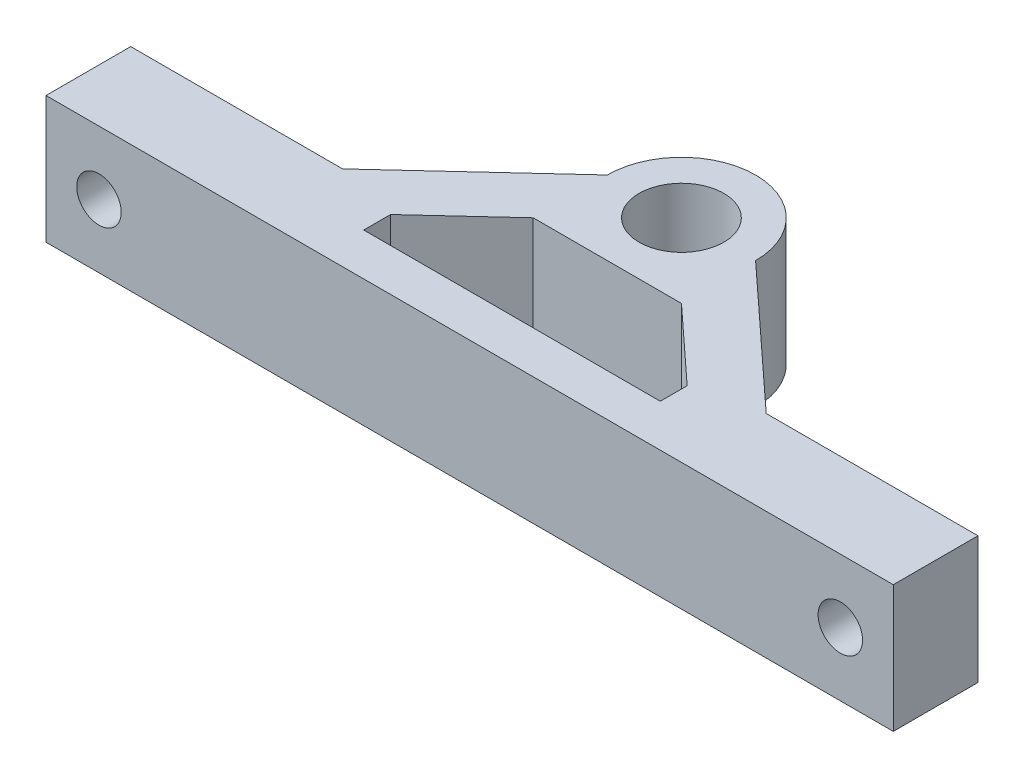
ISO-10303-21;
HEADER;
FILE_DESCRIPTION(('STEP AP214'),'2;1');
FILE_NAME('part.step','',(''),(''),'','','');
FILE_SCHEMA(('AUTOMOTIVE_DESIGN { 1 0 10303 214 1 1 1 1 }'));
ENDSEC;
DATA;
#1=APPLICATION_CONTEXT('core data for automotive mechanical design processes');
#2=APPLICATION_PROTOCOL_DEFINITION('international standard','automotive_design',2000,#1);
#3=PRODUCT_CONTEXT('',#1,'mechanical');
#4=PRODUCT('Part','Part','',(#3));
#5=PRODUCT_RELATED_PRODUCT_CATEGORY('part','',(#4));
#6=PRODUCT_DEFINITION_FORMATION('','',#4);
#7=PRODUCT_DEFINITION_CONTEXT('part definition',#1,'design');
#8=PRODUCT_DEFINITION('design','',#6,#7);
#9=PRODUCT_DEFINITION_SHAPE('','',#8);
#10=(LENGTH_UNIT() NAMED_UNIT(*) SI_UNIT(.MILLI.,.METRE.));
#11=(NAMED_UNIT(*) PLANE_ANGLE_UNIT() SI_UNIT($,.RADIAN.));
#12=(NAMED_UNIT(*) SI_UNIT($,.STERADIAN.) SOLID_ANGLE_UNIT());
#13=UNCERTAINTY_MEASURE_WITH_UNIT(LENGTH_MEASURE(1.E-05),#10,'distance_accuracy_value','');
#14=(GEOMETRIC_REPRESENTATION_CONTEXT(3) GLOBAL_UNCERTAINTY_ASSIGNED_CONTEXT((#13)) GLOBAL_UNIT_ASSIGNED_CONTEXT((#10,
#11,#12)) REPRESENTATION_CONTEXT('',''));
#15=CARTESIAN_POINT('',(0.,0.,0.));
#16=DIRECTION('',(0.,0.,1.));
#17=DIRECTION('',(1.,0.,0.));
#18=AXIS2_PLACEMENT_3D('',#15,#16,#17);
#19=CARTESIAN_POINT('',(0.,12.,0.));
#20=DIRECTION('',(0.,1.,0.));
#21=DIRECTION('',(0.,0.,1.));
#22=AXIS2_PLACEMENT_3D('',#19,#20,#21);
#23=PLANE('',#22);
#24=DIRECTION('',(0.,0.,1.));
#25=VECTOR('',#24,1.);
#26=CARTESIAN_POINT('',(-40.,12.,20.));
#27=LINE('',#26,#25);
#28=CARTESIAN_POINT('',(-40.,12.,12.));
#29=VERTEX_POINT('',#28);
#30=CARTESIAN_POINT('',(-40.,12.,20.));
#31=VERTEX_POINT('',#30);
#32=EDGE_CURVE('E195',#29,#31,#27,.T.);
#33=ORIENTED_EDGE('',*,*,#32,.T.);
#34=DIRECTION('',(1.,0.,0.));
#35=VECTOR('',#34,1.);
#36=CARTESIAN_POINT('',(-40.,12.,20.));
#37=LINE('',#36,#35);
#38=CARTESIAN_POINT('',(40.,12.,20.));
#39=VERTEX_POINT('',#38);
#40=EDGE_CURVE('E198',#31,#39,#37,.T.);
#41=ORIENTED_EDGE('',*,*,#40,.T.);
#42=DIRECTION('',(0.,0.,-1.));
#43=VECTOR('',#42,1.);
#44=CARTESIAN_POINT('',(40.,12.,20.));
#45=LINE('',#44,#43);
#46=CARTESIAN_POINT('',(40.,12.,12.));
#47=VERTEX_POINT('',#46);
#48=EDGE_CURVE('E201',#39,#47,#45,.T.);
#49=ORIENTED_EDGE('',*,*,#48,.T.);
#50=DIRECTION('',(-1.,0.,0.));
#51=VECTOR('',#50,1.);
#52=CARTESIAN_POINT('',(40.,12.,12.));
#53=LINE('',#52,#51);
#54=CARTESIAN_POINT('',(20.,12.,12.));
#55=VERTEX_POINT('',#54);
#56=EDGE_CURVE('E203',#47,#55,#53,.T.);
#57=ORIENTED_EDGE('',*,*,#56,.T.);
#58=DIRECTION('',(-0.734803444627488,0.,-0.678280102733065));
#59=VECTOR('',#58,1.);
#60=CARTESIAN_POINT('',(20.,12.,12.));
#61=LINE('',#60,#59);
#62=CARTESIAN_POINT('',(7.,12.,0.));
#63=VERTEX_POINT('',#62);
#64=EDGE_CURVE('E205',#55,#63,#61,.T.);
#65=ORIENTED_EDGE('',*,*,#64,.T.);
#66=CARTESIAN_POINT('',(0.,12.,0.));
#67=DIRECTION('',(0.,1.,0.));
#68=DIRECTION('',(0.,0.,1.));
#69=AXIS2_PLACEMENT_3D('',#66,#67,#68);
#70=CIRCLE('',#69,7.);
#71=CARTESIAN_POINT('',(-7.,12.,0.));
#72=VERTEX_POINT('',#71);
#73=EDGE_CURVE('E207',#63,#72,#70,.T.);
#74=ORIENTED_EDGE('',*,*,#73,.T.);
#75=DIRECTION('',(-0.734803444627488,0.,0.678280102733066));
#76=VECTOR('',#75,1.);
#77=CARTESIAN_POINT('',(-20.,12.,12.));
#78=LINE('',#77,#76);
#79=CARTESIAN_POINT('',(-20.,12.,12.));
#80=VERTEX_POINT('',#79);
#81=EDGE_CURVE('E209',#72,#80,#78,.T.);
#82=ORIENTED_EDGE('',*,*,#81,.T.);
#83=DIRECTION('',(-1.,0.,0.));
#84=VECTOR('',#83,1.);
#85=CARTESIAN_POINT('',(-40.,12.,12.));
#86=LINE('',#85,#84);
#87=EDGE_CURVE('E211',#80,#29,#86,.T.);
#88=ORIENTED_EDGE('',*,*,#87,.T.);
#89=EDGE_LOOP('',(#33,#41,#49,#57,#65,#74,#82,#88));
#90=FACE_BOUND('',#89,.T.);
#91=CARTESIAN_POINT('',(0.,12.,0.));
#92=DIRECTION('',(0.,1.,0.));
#93=DIRECTION('',(0.,0.,1.));
#94=AXIS2_PLACEMENT_3D('',#91,#92,#93);
#95=CIRCLE('',#94,4.);
#96=CARTESIAN_POINT('',(0.,12.,4.));
#97=VERTEX_POINT('',#96);
#98=EDGE_CURVE('E189',#97,#97,#95,.T.);
#99=ORIENTED_EDGE('',*,*,#98,.F.);
#100=EDGE_LOOP('',(#99));
#101=FACE_BOUND('',#100,.T.);
#102=DIRECTION('',(1.,0.,0.));
#103=VECTOR('',#102,1.);
#104=CARTESIAN_POINT('',(-14.,12.,16.));
#105=LINE('',#104,#103);
#106=CARTESIAN_POINT('',(-14.,12.,16.));
#107=VERTEX_POINT('',#106);
#108=CARTESIAN_POINT('',(14.,12.,16.));
#109=VERTEX_POINT('',#108);
#110=EDGE_CURVE('E144',#107,#109,#105,.T.);
#111=ORIENTED_EDGE('',*,*,#110,.F.);
#112=DIRECTION('',(0.,0.,1.));
#113=VECTOR('',#112,1.);
#114=CARTESIAN_POINT('',(-14.,12.,13.4615384615385));
#115=LINE('',#114,#113);
#116=CARTESIAN_POINT('',(-14.,12.,13.4615384615385));
#117=VERTEX_POINT('',#116);
#118=EDGE_CURVE('E136',#117,#107,#115,.T.);
#119=ORIENTED_EDGE('',*,*,#118,.F.);
#120=DIRECTION('',(-0.734803444627488,0.,0.678280102733066));
#121=VECTOR('',#120,1.);
#122=CARTESIAN_POINT('',(-7.,12.,7.));
#123=LINE('',#122,#121);
#124=CARTESIAN_POINT('',(-7.,12.,7.));
#125=VERTEX_POINT('',#124);
#126=EDGE_CURVE('E166',#125,#117,#123,.T.);
#127=ORIENTED_EDGE('',*,*,#126,.F.);
#128=DIRECTION('',(-1.,0.,0.));
#129=VECTOR('',#128,1.);
#130=CARTESIAN_POINT('',(7.,12.,7.));
#131=LINE('',#130,#129);
#132=CARTESIAN_POINT('',(7.,12.,7.));
#133=VERTEX_POINT('',#132);
#134=EDGE_CURVE('E164',#133,#125,#131,.T.);
#135=ORIENTED_EDGE('',*,*,#134,.F.);
#136=DIRECTION('',(-0.734803444627488,0.,-0.678280102733066));
#137=VECTOR('',#136,1.);
#138=CARTESIAN_POINT('',(14.,12.,13.4615384615385));
#139=LINE('',#138,#137);
#140=CARTESIAN_POINT('',(14.,12.,13.4615384615385));
#141=VERTEX_POINT('',#140);
#142=EDGE_CURVE('E159',#141,#133,#139,.T.);
#143=ORIENTED_EDGE('',*,*,#142,.F.);
#144=DIRECTION('',(0.,0.,-1.));
#145=VECTOR('',#144,1.);
#146=CARTESIAN_POINT('',(14.,12.,16.));
#147=LINE('',#146,#145);
#148=EDGE_CURVE('E157',#109,#141,#147,.T.);
#149=ORIENTED_EDGE('',*,*,#148,.F.);
#150=EDGE_LOOP('',(#111,#119,#127,#135,#143,#149));
#151=FACE_BOUND('',#150,.T.);
#152=ADVANCED_FACE('F35',(#90,#101,#151),#23,.T.);
#153=CARTESIAN_POINT('',(0.,0.,0.));
#154=DIRECTION('',(0.,1.,0.));
#155=DIRECTION('',(0.,0.,1.));
#156=AXIS2_PLACEMENT_3D('',#153,#154,#155);
#157=PLANE('',#156);
#158=CARTESIAN_POINT('',(0.,0.,0.));
#159=DIRECTION('',(0.,1.,0.));
#160=DIRECTION('',(0.,0.,1.));
#161=AXIS2_PLACEMENT_3D('',#158,#159,#160);
#162=CIRCLE('',#161,4.);
#163=CARTESIAN_POINT('',(0.,0.,4.));
#164=VERTEX_POINT('',#163);
#165=EDGE_CURVE('E152',#164,#164,#162,.T.);
#166=ORIENTED_EDGE('',*,*,#165,.T.);
#167=EDGE_LOOP('',(#166));
#168=FACE_BOUND('',#167,.T.);
#169=DIRECTION('',(0.,0.,1.));
#170=VECTOR('',#169,1.);
#171=CARTESIAN_POINT('',(-40.,0.,20.));
#172=LINE('',#171,#170);
#173=CARTESIAN_POINT('',(-40.,0.,12.));
#174=VERTEX_POINT('',#173);
#175=CARTESIAN_POINT('',(-40.,0.,20.));
#176=VERTEX_POINT('',#175);
#177=EDGE_CURVE('E192',#174,#176,#172,.T.);
#178=ORIENTED_EDGE('',*,*,#177,.F.);
#179=DIRECTION('',(-1.,0.,0.));
#180=VECTOR('',#179,1.);
#181=CARTESIAN_POINT('',(-40.,0.,12.));
#182=LINE('',#181,#180);
#183=CARTESIAN_POINT('',(-20.,0.,12.));
#184=VERTEX_POINT('',#183);
#185=EDGE_CURVE('E199',#184,#174,#182,.T.);
#186=ORIENTED_EDGE('',*,*,#185,.F.);
#187=DIRECTION('',(-0.734803444627488,0.,0.678280102733066));
#188=VECTOR('',#187,1.);
#189=CARTESIAN_POINT('',(-20.,0.,12.));
#190=LINE('',#189,#188);
#191=CARTESIAN_POINT('',(-7.,0.,0.));
#192=VERTEX_POINT('',#191);
#193=EDGE_CURVE('E226',#192,#184,#190,.T.);
#194=ORIENTED_EDGE('',*,*,#193,.F.);
#195=CARTESIAN_POINT('',(0.,0.,0.));
#196=DIRECTION('',(0.,1.,0.));
#197=DIRECTION('',(0.,0.,1.));
#198=AXIS2_PLACEMENT_3D('',#195,#196,#197);
#199=CIRCLE('',#198,7.);
#200=CARTESIAN_POINT('',(7.,0.,0.));
#201=VERTEX_POINT('',#200);
#202=EDGE_CURVE('E224',#201,#192,#199,.T.);
#203=ORIENTED_EDGE('',*,*,#202,.F.);
#204=DIRECTION('',(-0.734803444627488,0.,-0.678280102733065));
#205=VECTOR('',#204,1.);
#206=CARTESIAN_POINT('',(20.,0.,12.));
#207=LINE('',#206,#205);
#208=CARTESIAN_POINT('',(20.,0.,12.));
#209=VERTEX_POINT('',#208);
#210=EDGE_CURVE('E222',#209,#201,#207,.T.);
#211=ORIENTED_EDGE('',*,*,#210,.F.);
#212=DIRECTION('',(-1.,0.,0.));
#213=VECTOR('',#212,1.);
#214=CARTESIAN_POINT('',(40.,0.,12.));
#215=LINE('',#214,#213);
#216=CARTESIAN_POINT('',(40.,0.,12.));
#217=VERTEX_POINT('',#216);
#218=EDGE_CURVE('E220',#217,#209,#215,.T.);
#219=ORIENTED_EDGE('',*,*,#218,.F.);
#220=DIRECTION('',(0.,0.,-1.));
#221=VECTOR('',#220,1.);
#222=CARTESIAN_POINT('',(40.,0.,20.));
#223=LINE('',#222,#221);
#224=CARTESIAN_POINT('',(40.,0.,20.));
#225=VERTEX_POINT('',#224);
#226=EDGE_CURVE('E218',#225,#217,#223,.T.);
#227=ORIENTED_EDGE('',*,*,#226,.F.);
#228=DIRECTION('',(1.,0.,0.));
#229=VECTOR('',#228,1.);
#230=CARTESIAN_POINT('',(-40.,0.,20.));
#231=LINE('',#230,#229);
#232=EDGE_CURVE('E216',#176,#225,#231,.T.);
#233=ORIENTED_EDGE('',*,*,#232,.F.);
#234=EDGE_LOOP('',(#178,#186,#194,#203,#211,#219,#227,#233));
#235=FACE_BOUND('',#234,.T.);
#236=DIRECTION('',(0.,0.,1.));
#237=VECTOR('',#236,1.);
#238=CARTESIAN_POINT('',(-14.,0.,13.4615384615385));
#239=LINE('',#238,#237);
#240=CARTESIAN_POINT('',(-14.,0.,13.4615384615385));
#241=VERTEX_POINT('',#240);
#242=CARTESIAN_POINT('',(-14.,0.,16.));
#243=VERTEX_POINT('',#242);
#244=EDGE_CURVE('E58',#241,#243,#239,.T.);
#245=ORIENTED_EDGE('',*,*,#244,.T.);
#246=DIRECTION('',(1.,0.,0.));
#247=VECTOR('',#246,1.);
#248=CARTESIAN_POINT('',(-14.,0.,16.));
#249=LINE('',#248,#247);
#250=CARTESIAN_POINT('',(14.,0.,16.));
#251=VERTEX_POINT('',#250);
#252=EDGE_CURVE('E151',#243,#251,#249,.T.);
#253=ORIENTED_EDGE('',*,*,#252,.T.);
#254=DIRECTION('',(0.,0.,-1.));
#255=VECTOR('',#254,1.);
#256=CARTESIAN_POINT('',(14.,0.,16.));
#257=LINE('',#256,#255);
#258=CARTESIAN_POINT('',(14.,0.,13.4615384615385));
#259=VERTEX_POINT('',#258);
#260=EDGE_CURVE('E171',#251,#259,#257,.T.);
#261=ORIENTED_EDGE('',*,*,#260,.T.);
#262=DIRECTION('',(-0.734803444627488,0.,-0.678280102733066));
#263=VECTOR('',#262,1.);
#264=CARTESIAN_POINT('',(14.,0.,13.4615384615385));
#265=LINE('',#264,#263);
#266=CARTESIAN_POINT('',(7.,0.,7.));
#267=VERTEX_POINT('',#266);
#268=EDGE_CURVE('E174',#259,#267,#265,.T.);
#269=ORIENTED_EDGE('',*,*,#268,.T.);
#270=DIRECTION('',(-1.,0.,0.));
#271=VECTOR('',#270,1.);
#272=CARTESIAN_POINT('',(7.,0.,7.));
#273=LINE('',#272,#271);
#274=CARTESIAN_POINT('',(-7.,0.,7.));
#275=VERTEX_POINT('',#274);
#276=EDGE_CURVE('E177',#267,#275,#273,.T.);
#277=ORIENTED_EDGE('',*,*,#276,.T.);
#278=DIRECTION('',(-0.734803444627488,0.,0.678280102733066));
#279=VECTOR('',#278,1.);
#280=CARTESIAN_POINT('',(-7.,0.,7.));
#281=LINE('',#280,#279);
#282=EDGE_CURVE('E145',#275,#241,#281,.T.);
#283=ORIENTED_EDGE('',*,*,#282,.T.);
#284=EDGE_LOOP('',(#245,#253,#261,#269,#277,#283));
#285=FACE_BOUND('',#284,.T.);
#286=ADVANCED_FACE('F256',(#168,#235,#285),#157,.F.);
#287=CARTESIAN_POINT('',(-40.,12.,20.));
#288=DIRECTION('',(1.,0.,0.));
#289=DIRECTION('',(0.,0.,-1.));
#290=AXIS2_PLACEMENT_3D('',#287,#288,#289);
#291=PLANE('',#290);
#292=ORIENTED_EDGE('',*,*,#177,.T.);
#293=DIRECTION('',(0.,-1.,0.));
#294=VECTOR('',#293,1.);
#295=CARTESIAN_POINT('',(-40.,12.,20.));
#296=LINE('',#295,#294);
#297=EDGE_CURVE('E11',#31,#176,#296,.T.);
#298=ORIENTED_EDGE('',*,*,#297,.F.);
#299=ORIENTED_EDGE('',*,*,#32,.F.);
#300=DIRECTION('',(0.,-1.,0.));
#301=VECTOR('',#300,1.);
#302=CARTESIAN_POINT('',(-40.,12.,12.));
#303=LINE('',#302,#301);
#304=EDGE_CURVE('E213',#29,#174,#303,.T.);
#305=ORIENTED_EDGE('',*,*,#304,.T.);
#306=EDGE_LOOP('',(#292,#298,#299,#305));
#307=FACE_BOUND('',#306,.T.);
#308=ADVANCED_FACE('F37',(#307),#291,.F.);
#309=CARTESIAN_POINT('',(-40.,12.,20.));
#310=DIRECTION('',(0.,0.,-1.));
#311=DIRECTION('',(-1.,0.,0.));
#312=AXIS2_PLACEMENT_3D('',#309,#310,#311);
#313=PLANE('',#312);
#314=CARTESIAN_POINT('',(-35.,6.,20.));
#315=DIRECTION('',(0.,0.,1.));
#316=DIRECTION('',(1.,0.,0.));
#317=AXIS2_PLACEMENT_3D('',#314,#315,#316);
#318=CIRCLE('',#317,2.1);
#319=CARTESIAN_POINT('',(-32.9,6.,20.));
#320=VERTEX_POINT('',#319);
#321=EDGE_CURVE('E318',#320,#320,#318,.T.);
#322=ORIENTED_EDGE('',*,*,#321,.F.);
#323=EDGE_LOOP('',(#322));
#324=FACE_BOUND('',#323,.T.);
#325=CARTESIAN_POINT('',(35.,6.,20.));
#326=DIRECTION('',(0.,0.,1.));
#327=DIRECTION('',(1.,0.,0.));
#328=AXIS2_PLACEMENT_3D('',#325,#326,#327);
#329=CIRCLE('',#328,2.1);
#330=CARTESIAN_POINT('',(37.1,6.,20.));
#331=VERTEX_POINT('',#330);
#332=EDGE_CURVE('E317',#331,#331,#329,.T.);
#333=ORIENTED_EDGE('',*,*,#332,.F.);
#334=EDGE_LOOP('',(#333));
#335=FACE_BOUND('',#334,.T.);
#336=ORIENTED_EDGE('',*,*,#232,.T.);
#337=DIRECTION('',(0.,-1.,0.));
#338=VECTOR('',#337,1.);
#339=CARTESIAN_POINT('',(40.,12.,20.));
#340=LINE('',#339,#338);
#341=EDGE_CURVE('E43',#39,#225,#340,.T.);
#342=ORIENTED_EDGE('',*,*,#341,.F.);
#343=ORIENTED_EDGE('',*,*,#40,.F.);
#344=ORIENTED_EDGE('',*,*,#297,.T.);
#345=EDGE_LOOP('',(#336,#342,#343,#344));
#346=FACE_BOUND('',#345,.T.);
#347=ADVANCED_FACE('F274',(#324,#335,#346),#313,.F.);
#348=CARTESIAN_POINT('',(40.,12.,20.));
#349=DIRECTION('',(-1.,0.,0.));
#350=DIRECTION('',(0.,0.,1.));
#351=AXIS2_PLACEMENT_3D('',#348,#349,#350);
#352=PLANE('',#351);
#353=ORIENTED_EDGE('',*,*,#226,.T.);
#354=DIRECTION('',(0.,-1.,0.));
#355=VECTOR('',#354,1.);
#356=CARTESIAN_POINT('',(40.,12.,12.));
#357=LINE('',#356,#355);
#358=EDGE_CURVE('E243',#47,#217,#357,.T.);
#359=ORIENTED_EDGE('',*,*,#358,.F.);
#360=ORIENTED_EDGE('',*,*,#48,.F.);
#361=ORIENTED_EDGE('',*,*,#341,.T.);
#362=EDGE_LOOP('',(#353,#359,#360,#361));
#363=FACE_BOUND('',#362,.T.);
#364=ADVANCED_FACE('F250',(#363),#352,.F.);
#365=CARTESIAN_POINT('',(40.,12.,12.));
#366=DIRECTION('',(0.,0.,1.));
#367=DIRECTION('',(1.,0.,0.));
#368=AXIS2_PLACEMENT_3D('',#365,#366,#367);
#369=PLANE('',#368);
#370=CARTESIAN_POINT('',(35.,6.,12.));
#371=DIRECTION('',(0.,0.,1.));
#372=DIRECTION('',(1.,0.,0.));
#373=AXIS2_PLACEMENT_3D('',#370,#371,#372);
#374=CIRCLE('',#373,2.1);
#375=CARTESIAN_POINT('',(37.1,6.,12.));
#376=VERTEX_POINT('',#375);
#377=EDGE_CURVE('E169',#376,#376,#374,.T.);
#378=ORIENTED_EDGE('',*,*,#377,.T.);
#379=EDGE_LOOP('',(#378));
#380=FACE_BOUND('',#379,.T.);
#381=ORIENTED_EDGE('',*,*,#218,.T.);
#382=DIRECTION('',(0.,-1.,0.));
#383=VECTOR('',#382,1.);
#384=CARTESIAN_POINT('',(20.,12.,12.));
#385=LINE('',#384,#383);
#386=EDGE_CURVE('E240',#55,#209,#385,.T.);
#387=ORIENTED_EDGE('',*,*,#386,.F.);
#388=ORIENTED_EDGE('',*,*,#56,.F.);
#389=ORIENTED_EDGE('',*,*,#358,.T.);
#390=EDGE_LOOP('',(#381,#387,#388,#389));
#391=FACE_BOUND('',#390,.T.);
#392=ADVANCED_FACE('F262',(#380,#391),#369,.F.);
#393=CARTESIAN_POINT('',(20.,12.,12.));
#394=DIRECTION('',(-0.678280102733066,0.,0.734803444627488));
#395=DIRECTION('',(0.734803444627488,0.,0.678280102733066));
#396=AXIS2_PLACEMENT_3D('',#393,#394,#395);
#397=PLANE('',#396);
#398=ORIENTED_EDGE('',*,*,#210,.T.);
#399=DIRECTION('',(0.,-1.,0.));
#400=VECTOR('',#399,1.);
#401=CARTESIAN_POINT('',(7.,12.,0.));
#402=LINE('',#401,#400);
#403=EDGE_CURVE('E237',#63,#201,#402,.T.);
#404=ORIENTED_EDGE('',*,*,#403,.F.);
#405=ORIENTED_EDGE('',*,*,#64,.F.);
#406=ORIENTED_EDGE('',*,*,#386,.T.);
#407=EDGE_LOOP('',(#398,#404,#405,#406));
#408=FACE_BOUND('',#407,.T.);
#409=ADVANCED_FACE('F266',(#408),#397,.F.);
#410=CARTESIAN_POINT('',(0.,12.,0.));
#411=DIRECTION('',(0.,-1.,0.));
#412=DIRECTION('',(0.,0.,-1.));
#413=AXIS2_PLACEMENT_3D('',#410,#411,#412);
#414=CYLINDRICAL_SURFACE('',#413,7.);
#415=ORIENTED_EDGE('',*,*,#202,.T.);
#416=DIRECTION('',(0.,-1.,0.));
#417=VECTOR('',#416,1.);
#418=CARTESIAN_POINT('',(-7.,12.,0.));
#419=LINE('',#418,#417);
#420=EDGE_CURVE('E234',#72,#192,#419,.T.);
#421=ORIENTED_EDGE('',*,*,#420,.F.);
#422=ORIENTED_EDGE('',*,*,#73,.F.);
#423=ORIENTED_EDGE('',*,*,#403,.T.);
#424=EDGE_LOOP('',(#415,#421,#422,#423));
#425=FACE_BOUND('',#424,.T.);
#426=ADVANCED_FACE('F287',(#425),#414,.T.);
#427=CARTESIAN_POINT('',(-20.,12.,12.));
#428=DIRECTION('',(0.678280102733066,0.,0.734803444627488));
#429=DIRECTION('',(0.734803444627488,0.,-0.678280102733066));
#430=AXIS2_PLACEMENT_3D('',#427,#428,#429);
#431=PLANE('',#430);
#432=ORIENTED_EDGE('',*,*,#193,.T.);
#433=DIRECTION('',(0.,-1.,0.));
#434=VECTOR('',#433,1.);
#435=CARTESIAN_POINT('',(-20.,12.,12.));
#436=LINE('',#435,#434);
#437=EDGE_CURVE('E231',#80,#184,#436,.T.);
#438=ORIENTED_EDGE('',*,*,#437,.F.);
#439=ORIENTED_EDGE('',*,*,#81,.F.);
#440=ORIENTED_EDGE('',*,*,#420,.T.);
#441=EDGE_LOOP('',(#432,#438,#439,#440));
#442=FACE_BOUND('',#441,.T.);
#443=ADVANCED_FACE('F285',(#442),#431,.F.);
#444=CARTESIAN_POINT('',(-40.,12.,12.));
#445=DIRECTION('',(0.,0.,1.));
#446=DIRECTION('',(1.,0.,0.));
#447=AXIS2_PLACEMENT_3D('',#444,#445,#446);
#448=PLANE('',#447);
#449=CARTESIAN_POINT('',(-35.,6.,12.));
#450=DIRECTION('',(0.,0.,1.));
#451=DIRECTION('',(1.,0.,0.));
#452=AXIS2_PLACEMENT_3D('',#449,#450,#451);
#453=CIRCLE('',#452,2.1);
#454=CARTESIAN_POINT('',(-32.9,6.,12.));
#455=VERTEX_POINT('',#454);
#456=EDGE_CURVE('E315',#455,#455,#453,.T.);
#457=ORIENTED_EDGE('',*,*,#456,.T.);
#458=EDGE_LOOP('',(#457));
#459=FACE_BOUND('',#458,.T.);
#460=ORIENTED_EDGE('',*,*,#185,.T.);
#461=ORIENTED_EDGE('',*,*,#304,.F.);
#462=ORIENTED_EDGE('',*,*,#87,.F.);
#463=ORIENTED_EDGE('',*,*,#437,.T.);
#464=EDGE_LOOP('',(#460,#461,#462,#463));
#465=FACE_BOUND('',#464,.T.);
#466=ADVANCED_FACE('F280',(#459,#465),#448,.F.);
#467=CARTESIAN_POINT('',(0.,12.,0.));
#468=DIRECTION('',(0.,-1.,0.));
#469=DIRECTION('',(0.,0.,-1.));
#470=AXIS2_PLACEMENT_3D('',#467,#468,#469);
#471=CYLINDRICAL_SURFACE('',#470,4.);
#472=ORIENTED_EDGE('',*,*,#98,.T.);
#473=EDGE_LOOP('',(#472));
#474=FACE_BOUND('',#473,.T.);
#475=ORIENTED_EDGE('',*,*,#165,.F.);
#476=EDGE_LOOP('',(#475));
#477=FACE_BOUND('',#476,.T.);
#478=ADVANCED_FACE('F304',(#474,#477),#471,.F.);
#479=CARTESIAN_POINT('',(-14.,12.,13.4615384615385));
#480=DIRECTION('',(1.,0.,0.));
#481=DIRECTION('',(0.,0.,-1.));
#482=AXIS2_PLACEMENT_3D('',#479,#480,#481);
#483=PLANE('',#482);
#484=ORIENTED_EDGE('',*,*,#244,.F.);
#485=DIRECTION('',(0.,-1.,0.));
#486=VECTOR('',#485,1.);
#487=CARTESIAN_POINT('',(-14.,12.,13.4615384615385));
#488=LINE('',#487,#486);
#489=EDGE_CURVE('E140',#117,#241,#488,.T.);
#490=ORIENTED_EDGE('',*,*,#489,.F.);
#491=ORIENTED_EDGE('',*,*,#118,.T.);
#492=DIRECTION('',(0.,-1.,0.));
#493=VECTOR('',#492,1.);
#494=CARTESIAN_POINT('',(-14.,12.,16.));
#495=LINE('',#494,#493);
#496=EDGE_CURVE('E139',#107,#243,#495,.T.);
#497=ORIENTED_EDGE('',*,*,#496,.T.);
#498=EDGE_LOOP('',(#484,#490,#491,#497));
#499=FACE_BOUND('',#498,.T.);
#500=ADVANCED_FACE('F138',(#499),#483,.T.);
#501=CARTESIAN_POINT('',(-14.,12.,16.));
#502=DIRECTION('',(0.,0.,-1.));
#503=DIRECTION('',(-1.,0.,0.));
#504=AXIS2_PLACEMENT_3D('',#501,#502,#503);
#505=PLANE('',#504);
#506=ORIENTED_EDGE('',*,*,#252,.F.);
#507=ORIENTED_EDGE('',*,*,#496,.F.);
#508=ORIENTED_EDGE('',*,*,#110,.T.);
#509=DIRECTION('',(0.,-1.,0.));
#510=VECTOR('',#509,1.);
#511=CARTESIAN_POINT('',(14.,12.,16.));
#512=LINE('',#511,#510);
#513=EDGE_CURVE('E153',#109,#251,#512,.T.);
#514=ORIENTED_EDGE('',*,*,#513,.T.);
#515=EDGE_LOOP('',(#506,#507,#508,#514));
#516=FACE_BOUND('',#515,.T.);
#517=ADVANCED_FACE('F148',(#516),#505,.T.);
#518=CARTESIAN_POINT('',(14.,12.,16.));
#519=DIRECTION('',(-1.,0.,0.));
#520=DIRECTION('',(0.,0.,1.));
#521=AXIS2_PLACEMENT_3D('',#518,#519,#520);
#522=PLANE('',#521);
#523=ORIENTED_EDGE('',*,*,#260,.F.);
#524=ORIENTED_EDGE('',*,*,#513,.F.);
#525=ORIENTED_EDGE('',*,*,#148,.T.);
#526=DIRECTION('',(0.,-1.,0.));
#527=VECTOR('',#526,1.);
#528=CARTESIAN_POINT('',(14.,12.,13.4615384615385));
#529=LINE('',#528,#527);
#530=EDGE_CURVE('E186',#141,#259,#529,.T.);
#531=ORIENTED_EDGE('',*,*,#530,.T.);
#532=EDGE_LOOP('',(#523,#524,#525,#531));
#533=FACE_BOUND('',#532,.T.);
#534=ADVANCED_FACE('F390',(#533),#522,.T.);
#535=CARTESIAN_POINT('',(14.,12.,13.4615384615385));
#536=DIRECTION('',(-0.678280102733066,0.,0.734803444627488));
#537=DIRECTION('',(0.734803444627488,0.,0.678280102733066));
#538=AXIS2_PLACEMENT_3D('',#535,#536,#537);
#539=PLANE('',#538);
#540=ORIENTED_EDGE('',*,*,#268,.F.);
#541=ORIENTED_EDGE('',*,*,#530,.F.);
#542=ORIENTED_EDGE('',*,*,#142,.T.);
#543=DIRECTION('',(0.,-1.,0.));
#544=VECTOR('',#543,1.);
#545=CARTESIAN_POINT('',(7.,12.,7.));
#546=LINE('',#545,#544);
#547=EDGE_CURVE('E184',#133,#267,#546,.T.);
#548=ORIENTED_EDGE('',*,*,#547,.T.);
#549=EDGE_LOOP('',(#540,#541,#542,#548));
#550=FACE_BOUND('',#549,.T.);
#551=ADVANCED_FACE('F399',(#550),#539,.T.);
#552=CARTESIAN_POINT('',(7.,12.,7.));
#553=DIRECTION('',(0.,0.,1.));
#554=DIRECTION('',(1.,0.,0.));
#555=AXIS2_PLACEMENT_3D('',#552,#553,#554);
#556=PLANE('',#555);
#557=ORIENTED_EDGE('',*,*,#276,.F.);
#558=ORIENTED_EDGE('',*,*,#547,.F.);
#559=ORIENTED_EDGE('',*,*,#134,.T.);
#560=DIRECTION('',(0.,-1.,0.));
#561=VECTOR('',#560,1.);
#562=CARTESIAN_POINT('',(-7.,12.,7.));
#563=LINE('',#562,#561);
#564=EDGE_CURVE('E50',#125,#275,#563,.T.);
#565=ORIENTED_EDGE('',*,*,#564,.T.);
#566=EDGE_LOOP('',(#557,#558,#559,#565));
#567=FACE_BOUND('',#566,.T.);
#568=ADVANCED_FACE('F409',(#567),#556,.T.);
#569=CARTESIAN_POINT('',(-7.,12.,7.));
#570=DIRECTION('',(0.678280102733066,0.,0.734803444627488));
#571=DIRECTION('',(0.734803444627488,0.,-0.678280102733066));
#572=AXIS2_PLACEMENT_3D('',#569,#570,#571);
#573=PLANE('',#572);
#574=ORIENTED_EDGE('',*,*,#282,.F.);
#575=ORIENTED_EDGE('',*,*,#564,.F.);
#576=ORIENTED_EDGE('',*,*,#126,.T.);
#577=ORIENTED_EDGE('',*,*,#489,.T.);
#578=EDGE_LOOP('',(#574,#575,#576,#577));
#579=FACE_BOUND('',#578,.T.);
#580=ADVANCED_FACE('F332',(#579),#573,.T.);
#581=CARTESIAN_POINT('',(35.,6.,20.));
#582=DIRECTION('',(0.,0.,1.));
#583=DIRECTION('',(1.,0.,0.));
#584=AXIS2_PLACEMENT_3D('',#581,#582,#583);
#585=CYLINDRICAL_SURFACE('',#584,2.1);
#586=ORIENTED_EDGE('',*,*,#377,.F.);
#587=EDGE_LOOP('',(#586));
#588=FACE_BOUND('',#587,.T.);
#589=ORIENTED_EDGE('',*,*,#332,.T.);
#590=EDGE_LOOP('',(#589));
#591=FACE_BOUND('',#590,.T.);
#592=ADVANCED_FACE('F328',(#588,#591),#585,.F.);
#593=CARTESIAN_POINT('',(-35.,6.,20.));
#594=DIRECTION('',(0.,0.,1.));
#595=DIRECTION('',(1.,0.,0.));
#596=AXIS2_PLACEMENT_3D('',#593,#594,#595);
#597=CYLINDRICAL_SURFACE('',#596,2.1);
#598=ORIENTED_EDGE('',*,*,#456,.F.);
#599=EDGE_LOOP('',(#598));
#600=FACE_BOUND('',#599,.T.);
#601=ORIENTED_EDGE('',*,*,#321,.T.);
#602=EDGE_LOOP('',(#601));
#603=FACE_BOUND('',#602,.T.);
#604=ADVANCED_FACE('F331',(#600,#603),#597,.F.);
#605=CLOSED_SHELL('',(#152,#286,#308,#347,#364,#392,#409,#426,#443,#466,#478,#500,#517,#534,
#551,#568,#580,#592,#604));
#606=MANIFOLD_SOLID_BREP('B2',#605);
#607=ADVANCED_BREP_SHAPE_REPRESENTATION('',(#18,#606),#14);
#608=SHAPE_DEFINITION_REPRESENTATION(#9,#607);
ENDSEC;
END-ISO-10303-21;
